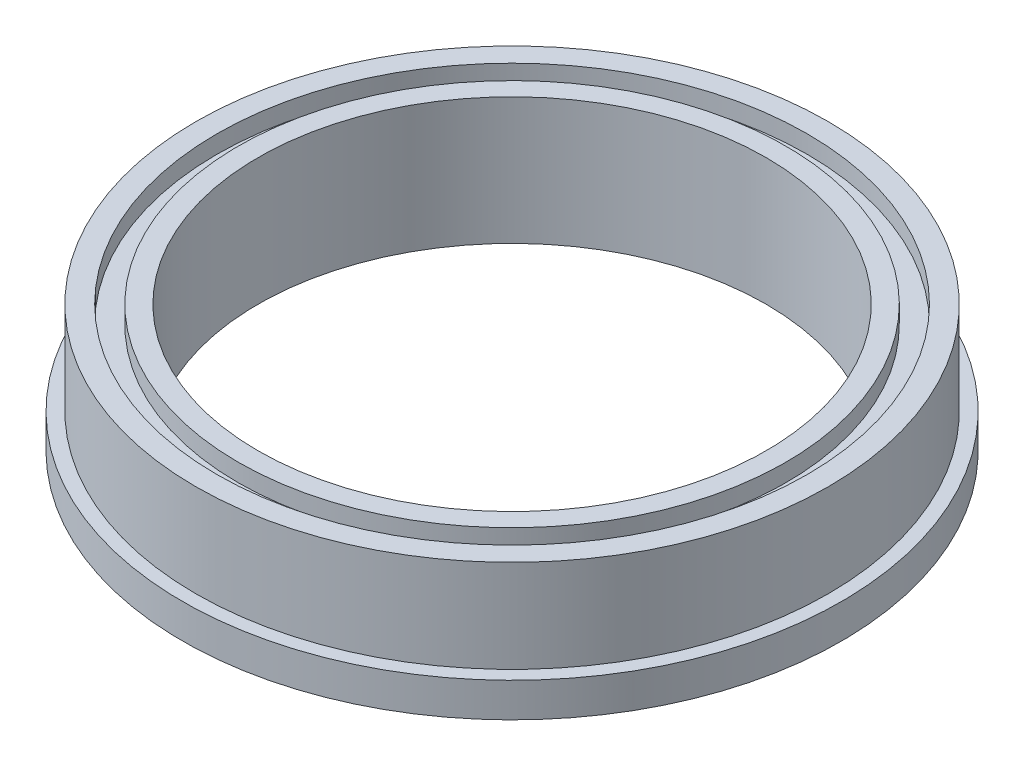
ISO-10303-21;
HEADER;
FILE_DESCRIPTION(('STEP AP214'),'2;1');
FILE_NAME('part.step','',(''),(''),'','','');
FILE_SCHEMA(('AUTOMOTIVE_DESIGN { 1 0 10303 214 1 1 1 1 }'));
ENDSEC;
DATA;
#1=APPLICATION_CONTEXT('core data for automotive mechanical design processes');
#2=APPLICATION_PROTOCOL_DEFINITION('international standard','automotive_design',2000,#1);
#3=PRODUCT_CONTEXT('',#1,'mechanical');
#4=PRODUCT('Part','Part','',(#3));
#5=PRODUCT_RELATED_PRODUCT_CATEGORY('part','',(#4));
#6=PRODUCT_DEFINITION_FORMATION('','',#4);
#7=PRODUCT_DEFINITION_CONTEXT('part definition',#1,'design');
#8=PRODUCT_DEFINITION('design','',#6,#7);
#9=PRODUCT_DEFINITION_SHAPE('','',#8);
#10=(LENGTH_UNIT() NAMED_UNIT(*) SI_UNIT(.MILLI.,.METRE.));
#11=(NAMED_UNIT(*) PLANE_ANGLE_UNIT() SI_UNIT($,.RADIAN.));
#12=(NAMED_UNIT(*) SI_UNIT($,.STERADIAN.) SOLID_ANGLE_UNIT());
#13=UNCERTAINTY_MEASURE_WITH_UNIT(LENGTH_MEASURE(1.E-05),#10,'distance_accuracy_value','');
#14=(GEOMETRIC_REPRESENTATION_CONTEXT(3) GLOBAL_UNCERTAINTY_ASSIGNED_CONTEXT((#13)) GLOBAL_UNIT_ASSIGNED_CONTEXT((#10,
#11,#12)) REPRESENTATION_CONTEXT('',''));
#15=CARTESIAN_POINT('',(0.,0.,0.));
#16=DIRECTION('',(0.,0.,1.));
#17=DIRECTION('',(1.,0.,0.));
#18=AXIS2_PLACEMENT_3D('',#15,#16,#17);
#19=CARTESIAN_POINT('',(0.,1.7145,0.));
#20=DIRECTION('',(0.,-1.,0.));
#21=DIRECTION('',(0.,0.,-1.));
#22=AXIS2_PLACEMENT_3D('',#19,#20,#21);
#23=PLANE('',#22);
#24=CARTESIAN_POINT('',(0.,1.7145,0.));
#25=DIRECTION('',(0.,-1.,0.));
#26=DIRECTION('',(0.,0.,-1.));
#27=AXIS2_PLACEMENT_3D('',#24,#25,#26);
#28=CIRCLE('',#27,16.47825);
#29=CARTESIAN_POINT('',(0.,1.7145,-16.47825));
#30=VERTEX_POINT('',#29);
#31=EDGE_CURVE('E20',#30,#30,#28,.T.);
#32=ORIENTED_EDGE('',*,*,#31,.F.);
#33=EDGE_LOOP('',(#32));
#34=FACE_BOUND('',#33,.T.);
#35=CARTESIAN_POINT('',(0.,1.7145,0.));
#36=DIRECTION('',(0.,-1.,0.));
#37=DIRECTION('',(0.,0.,-1.));
#38=AXIS2_PLACEMENT_3D('',#35,#36,#37);
#39=CIRCLE('',#38,15.8115);
#40=CARTESIAN_POINT('',(0.,1.7145,-15.8115));
#41=VERTEX_POINT('',#40);
#42=EDGE_CURVE('E60',#41,#41,#39,.F.);
#43=ORIENTED_EDGE('',*,*,#42,.F.);
#44=EDGE_LOOP('',(#43));
#45=FACE_BOUND('',#44,.T.);
#46=ADVANCED_FACE('F17',(#34,#45),#23,.F.);
#47=CARTESIAN_POINT('',(0.,1.7145,0.));
#48=DIRECTION('',(0.,-1.,0.));
#49=DIRECTION('',(0.,0.,-1.));
#50=AXIS2_PLACEMENT_3D('',#47,#48,#49);
#51=CYLINDRICAL_SURFACE('',#50,16.47825);
#52=CARTESIAN_POINT('',(0.,0.,0.));
#53=DIRECTION('',(0.,-1.,0.));
#54=DIRECTION('',(0.,0.,-1.));
#55=AXIS2_PLACEMENT_3D('',#52,#53,#54);
#56=CIRCLE('',#55,16.47825);
#57=CARTESIAN_POINT('',(0.,0.,-16.47825));
#58=VERTEX_POINT('',#57);
#59=EDGE_CURVE('E58',#58,#58,#56,.F.);
#60=ORIENTED_EDGE('',*,*,#59,.T.);
#61=EDGE_LOOP('',(#60));
#62=FACE_BOUND('',#61,.T.);
#63=ORIENTED_EDGE('',*,*,#31,.T.);
#64=EDGE_LOOP('',(#63));
#65=FACE_BOUND('',#64,.T.);
#66=ADVANCED_FACE('F67',(#62,#65),#51,.T.);
#67=CARTESIAN_POINT('',(0.,6.35,0.));
#68=DIRECTION('',(0.,-1.,0.));
#69=DIRECTION('',(0.,0.,-1.));
#70=AXIS2_PLACEMENT_3D('',#67,#68,#69);
#71=CYLINDRICAL_SURFACE('',#70,15.8115);
#72=ORIENTED_EDGE('',*,*,#42,.T.);
#73=EDGE_LOOP('',(#72));
#74=FACE_BOUND('',#73,.T.);
#75=CARTESIAN_POINT('',(0.,6.35,0.));
#76=DIRECTION('',(0.,-1.,0.));
#77=DIRECTION('',(0.,0.,-1.));
#78=AXIS2_PLACEMENT_3D('',#75,#76,#77);
#79=CIRCLE('',#78,15.8115);
#80=CARTESIAN_POINT('',(0.,6.35,-15.8115));
#81=VERTEX_POINT('',#80);
#82=EDGE_CURVE('E55',#81,#81,#79,.F.);
#83=ORIENTED_EDGE('',*,*,#82,.F.);
#84=EDGE_LOOP('',(#83));
#85=FACE_BOUND('',#84,.T.);
#86=ADVANCED_FACE('F75',(#74,#85),#71,.T.);
#87=CARTESIAN_POINT('',(0.,0.,0.));
#88=DIRECTION('',(0.,1.,0.));
#89=DIRECTION('',(0.,0.,1.));
#90=AXIS2_PLACEMENT_3D('',#87,#88,#89);
#91=PLANE('',#90);
#92=ORIENTED_EDGE('',*,*,#59,.F.);
#93=EDGE_LOOP('',(#92));
#94=FACE_BOUND('',#93,.T.);
#95=CARTESIAN_POINT('',(0.,0.,0.));
#96=DIRECTION('',(0.,-1.,0.));
#97=DIRECTION('',(0.,0.,-1.));
#98=AXIS2_PLACEMENT_3D('',#95,#96,#97);
#99=CIRCLE('',#98,14.7574);
#100=CARTESIAN_POINT('',(0.,0.,-14.7574));
#101=VERTEX_POINT('',#100);
#102=EDGE_CURVE('E52',#101,#101,#99,.F.);
#103=ORIENTED_EDGE('',*,*,#102,.T.);
#104=EDGE_LOOP('',(#103));
#105=FACE_BOUND('',#104,.T.);
#106=ADVANCED_FACE('F121',(#94,#105),#91,.F.);
#107=CARTESIAN_POINT('',(0.,6.35,0.));
#108=DIRECTION('',(0.,1.,0.));
#109=DIRECTION('',(0.,0.,1.));
#110=AXIS2_PLACEMENT_3D('',#107,#108,#109);
#111=PLANE('',#110);
#112=ORIENTED_EDGE('',*,*,#82,.T.);
#113=EDGE_LOOP('',(#112));
#114=FACE_BOUND('',#113,.T.);
#115=CARTESIAN_POINT('',(0.,6.35,0.));
#116=DIRECTION('',(0.,1.,0.));
#117=DIRECTION('',(0.,0.,1.));
#118=AXIS2_PLACEMENT_3D('',#115,#116,#117);
#119=CIRCLE('',#118,14.7574);
#120=CARTESIAN_POINT('',(0.,6.35,14.7574));
#121=VERTEX_POINT('',#120);
#122=EDGE_CURVE('E49',#121,#121,#119,.F.);
#123=ORIENTED_EDGE('',*,*,#122,.T.);
#124=EDGE_LOOP('',(#123));
#125=FACE_BOUND('',#124,.T.);
#126=ADVANCED_FACE('F117',(#114,#125),#111,.T.);
#127=CARTESIAN_POINT('',(0.,0.889,0.));
#128=DIRECTION('',(0.,-1.,0.));
#129=DIRECTION('',(0.,0.,-1.));
#130=AXIS2_PLACEMENT_3D('',#127,#128,#129);
#131=CYLINDRICAL_SURFACE('',#130,14.7574);
#132=ORIENTED_EDGE('',*,*,#102,.F.);
#133=EDGE_LOOP('',(#132));
#134=FACE_BOUND('',#133,.T.);
#135=CARTESIAN_POINT('',(0.,0.889,0.));
#136=DIRECTION('',(0.,-1.,0.));
#137=DIRECTION('',(0.,0.,-1.));
#138=AXIS2_PLACEMENT_3D('',#135,#136,#137);
#139=CIRCLE('',#138,14.7574);
#140=CARTESIAN_POINT('',(0.,0.889,-14.7574));
#141=VERTEX_POINT('',#140);
#142=EDGE_CURVE('E46',#141,#141,#139,.T.);
#143=ORIENTED_EDGE('',*,*,#142,.F.);
#144=EDGE_LOOP('',(#143));
#145=FACE_BOUND('',#144,.T.);
#146=ADVANCED_FACE('F113',(#134,#145),#131,.F.);
#147=CARTESIAN_POINT('',(0.,5.461,0.));
#148=DIRECTION('',(0.,1.,0.));
#149=DIRECTION('',(0.,0.,1.));
#150=AXIS2_PLACEMENT_3D('',#147,#148,#149);
#151=CYLINDRICAL_SURFACE('',#150,14.7574);
#152=ORIENTED_EDGE('',*,*,#122,.F.);
#153=EDGE_LOOP('',(#152));
#154=FACE_BOUND('',#153,.T.);
#155=CARTESIAN_POINT('',(0.,5.461,0.));
#156=DIRECTION('',(0.,1.,0.));
#157=DIRECTION('',(0.,0.,1.));
#158=AXIS2_PLACEMENT_3D('',#155,#156,#157);
#159=CIRCLE('',#158,14.7574);
#160=CARTESIAN_POINT('',(0.,5.461,14.7574));
#161=VERTEX_POINT('',#160);
#162=EDGE_CURVE('E43',#161,#161,#159,.T.);
#163=ORIENTED_EDGE('',*,*,#162,.F.);
#164=EDGE_LOOP('',(#163));
#165=FACE_BOUND('',#164,.T.);
#166=ADVANCED_FACE('F109',(#154,#165),#151,.F.);
#167=CARTESIAN_POINT('',(0.,0.889,0.));
#168=DIRECTION('',(0.,-1.,0.));
#169=DIRECTION('',(0.,0.,-1.));
#170=AXIS2_PLACEMENT_3D('',#167,#168,#169);
#171=PLANE('',#170);
#172=ORIENTED_EDGE('',*,*,#142,.T.);
#173=EDGE_LOOP('',(#172));
#174=FACE_BOUND('',#173,.T.);
#175=CARTESIAN_POINT('',(0.,0.889,0.));
#176=DIRECTION('',(0.,-1.,0.));
#177=DIRECTION('',(0.,0.,-1.));
#178=AXIS2_PLACEMENT_3D('',#175,#176,#177);
#179=CIRCLE('',#178,13.6906);
#180=CARTESIAN_POINT('',(0.,0.889,-13.6906));
#181=VERTEX_POINT('',#180);
#182=EDGE_CURVE('E40',#181,#181,#179,.T.);
#183=ORIENTED_EDGE('',*,*,#182,.F.);
#184=EDGE_LOOP('',(#183));
#185=FACE_BOUND('',#184,.T.);
#186=ADVANCED_FACE('F105',(#174,#185),#171,.T.);
#187=CARTESIAN_POINT('',(0.,5.461,0.));
#188=DIRECTION('',(0.,1.,0.));
#189=DIRECTION('',(0.,0.,1.));
#190=AXIS2_PLACEMENT_3D('',#187,#188,#189);
#191=PLANE('',#190);
#192=ORIENTED_EDGE('',*,*,#162,.T.);
#193=EDGE_LOOP('',(#192));
#194=FACE_BOUND('',#193,.T.);
#195=CARTESIAN_POINT('',(0.,5.461,0.));
#196=DIRECTION('',(0.,1.,0.));
#197=DIRECTION('',(0.,0.,1.));
#198=AXIS2_PLACEMENT_3D('',#195,#196,#197);
#199=CIRCLE('',#198,13.6906);
#200=CARTESIAN_POINT('',(0.,5.461,13.6906));
#201=VERTEX_POINT('',#200);
#202=EDGE_CURVE('E37',#201,#201,#199,.T.);
#203=ORIENTED_EDGE('',*,*,#202,.F.);
#204=EDGE_LOOP('',(#203));
#205=FACE_BOUND('',#204,.T.);
#206=ADVANCED_FACE('F101',(#194,#205),#191,.T.);
#207=CARTESIAN_POINT('',(0.,0.889,0.));
#208=DIRECTION('',(0.,-1.,0.));
#209=DIRECTION('',(0.,0.,-1.));
#210=AXIS2_PLACEMENT_3D('',#207,#208,#209);
#211=CYLINDRICAL_SURFACE('',#210,13.6906);
#212=CARTESIAN_POINT('',(0.,0.,0.));
#213=DIRECTION('',(0.,-1.,0.));
#214=DIRECTION('',(0.,0.,-1.));
#215=AXIS2_PLACEMENT_3D('',#212,#213,#214);
#216=CIRCLE('',#215,13.6906);
#217=CARTESIAN_POINT('',(0.,0.,-13.6906));
#218=VERTEX_POINT('',#217);
#219=EDGE_CURVE('E34',#218,#218,#216,.F.);
#220=ORIENTED_EDGE('',*,*,#219,.T.);
#221=EDGE_LOOP('',(#220));
#222=FACE_BOUND('',#221,.T.);
#223=ORIENTED_EDGE('',*,*,#182,.T.);
#224=EDGE_LOOP('',(#223));
#225=FACE_BOUND('',#224,.T.);
#226=ADVANCED_FACE('F97',(#222,#225),#211,.T.);
#227=CARTESIAN_POINT('',(0.,5.461,0.));
#228=DIRECTION('',(0.,1.,0.));
#229=DIRECTION('',(0.,0.,1.));
#230=AXIS2_PLACEMENT_3D('',#227,#228,#229);
#231=CYLINDRICAL_SURFACE('',#230,13.6906);
#232=ORIENTED_EDGE('',*,*,#202,.T.);
#233=EDGE_LOOP('',(#232));
#234=FACE_BOUND('',#233,.T.);
#235=CARTESIAN_POINT('',(0.,6.35,0.));
#236=DIRECTION('',(0.,1.,0.));
#237=DIRECTION('',(0.,0.,1.));
#238=AXIS2_PLACEMENT_3D('',#235,#236,#237);
#239=CIRCLE('',#238,13.6906);
#240=CARTESIAN_POINT('',(0.,6.35,13.6906));
#241=VERTEX_POINT('',#240);
#242=EDGE_CURVE('E29',#241,#241,#239,.T.);
#243=ORIENTED_EDGE('',*,*,#242,.F.);
#244=EDGE_LOOP('',(#243));
#245=FACE_BOUND('',#244,.T.);
#246=ADVANCED_FACE('F93',(#234,#245),#231,.T.);
#247=CARTESIAN_POINT('',(0.,0.,0.));
#248=DIRECTION('',(0.,1.,0.));
#249=DIRECTION('',(0.,0.,1.));
#250=AXIS2_PLACEMENT_3D('',#247,#248,#249);
#251=PLANE('',#250);
#252=ORIENTED_EDGE('',*,*,#219,.F.);
#253=EDGE_LOOP('',(#252));
#254=FACE_BOUND('',#253,.T.);
#255=CARTESIAN_POINT('',(0.,0.,0.));
#256=DIRECTION('',(0.,-1.,0.));
#257=DIRECTION('',(0.,0.,-1.));
#258=AXIS2_PLACEMENT_3D('',#255,#256,#257);
#259=CIRCLE('',#258,12.7);
#260=CARTESIAN_POINT('',(0.,0.,-12.7));
#261=VERTEX_POINT('',#260);
#262=EDGE_CURVE('E24',#261,#261,#259,.F.);
#263=ORIENTED_EDGE('',*,*,#262,.T.);
#264=EDGE_LOOP('',(#263));
#265=FACE_BOUND('',#264,.T.);
#266=ADVANCED_FACE('F85',(#254,#265),#251,.F.);
#267=CARTESIAN_POINT('',(0.,6.35,0.));
#268=DIRECTION('',(0.,1.,0.));
#269=DIRECTION('',(0.,0.,1.));
#270=AXIS2_PLACEMENT_3D('',#267,#268,#269);
#271=PLANE('',#270);
#272=ORIENTED_EDGE('',*,*,#242,.T.);
#273=EDGE_LOOP('',(#272));
#274=FACE_BOUND('',#273,.T.);
#275=CARTESIAN_POINT('',(0.,6.35,0.));
#276=DIRECTION('',(0.,-1.,0.));
#277=DIRECTION('',(0.,0.,-1.));
#278=AXIS2_PLACEMENT_3D('',#275,#276,#277);
#279=CIRCLE('',#278,12.7);
#280=CARTESIAN_POINT('',(0.,6.35,-12.7));
#281=VERTEX_POINT('',#280);
#282=EDGE_CURVE('E10',#281,#281,#279,.T.);
#283=ORIENTED_EDGE('',*,*,#282,.T.);
#284=EDGE_LOOP('',(#283));
#285=FACE_BOUND('',#284,.T.);
#286=ADVANCED_FACE('F79',(#274,#285),#271,.T.);
#287=CARTESIAN_POINT('',(0.,6.35,0.));
#288=DIRECTION('',(0.,-1.,0.));
#289=DIRECTION('',(0.,0.,-1.));
#290=AXIS2_PLACEMENT_3D('',#287,#288,#289);
#291=CYLINDRICAL_SURFACE('',#290,12.7);
#292=ORIENTED_EDGE('',*,*,#262,.F.);
#293=EDGE_LOOP('',(#292));
#294=FACE_BOUND('',#293,.T.);
#295=ORIENTED_EDGE('',*,*,#282,.F.);
#296=EDGE_LOOP('',(#295));
#297=FACE_BOUND('',#296,.T.);
#298=ADVANCED_FACE('F77',(#294,#297),#291,.F.);
#299=CLOSED_SHELL('',(#46,#66,#86,#106,#126,#146,#166,#186,#206,#226,#246,#266,#286,#298));
#300=MANIFOLD_SOLID_BREP('B1',#299);
#301=ADVANCED_BREP_SHAPE_REPRESENTATION('',(#18,#300),#14);
#302=SHAPE_DEFINITION_REPRESENTATION(#9,#301);
ENDSEC;
END-ISO-10303-21;
